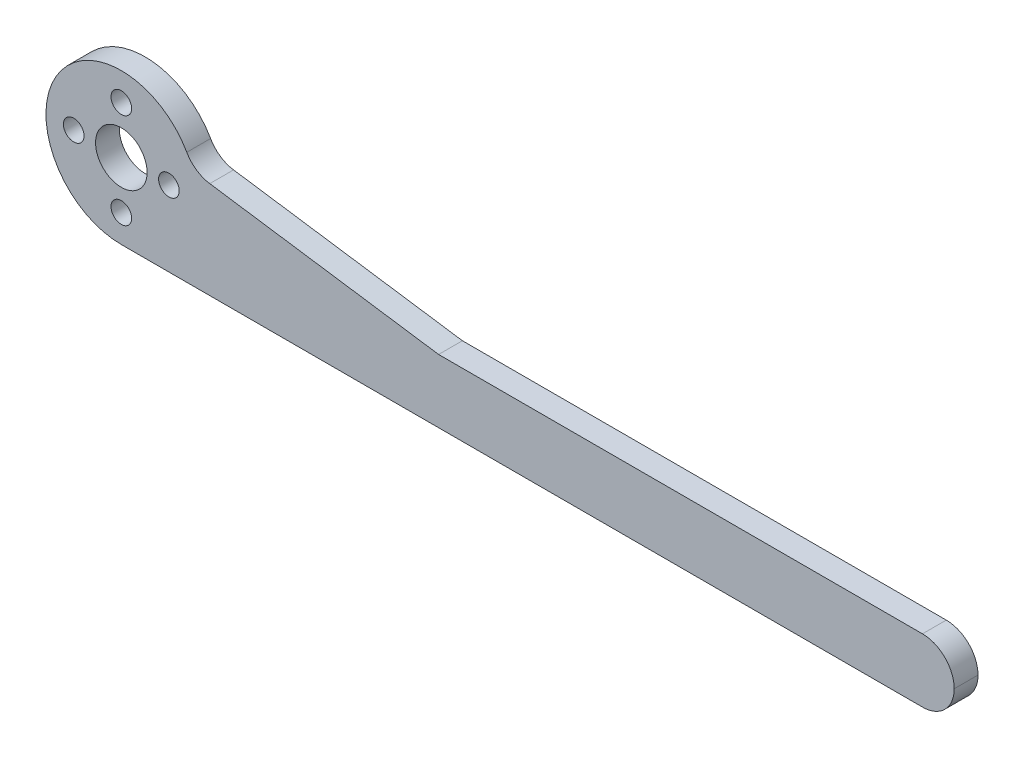
ISO-10303-21;
HEADER;
FILE_DESCRIPTION(('STEP AP214'),'2;1');
FILE_NAME('part.step','',(''),(''),'','','');
FILE_SCHEMA(('AUTOMOTIVE_DESIGN { 1 0 10303 214 1 1 1 1 }'));
ENDSEC;
DATA;
#1=APPLICATION_CONTEXT('core data for automotive mechanical design processes');
#2=APPLICATION_PROTOCOL_DEFINITION('international standard','automotive_design',2000,#1);
#3=PRODUCT_CONTEXT('',#1,'mechanical');
#4=PRODUCT('Part','Part','',(#3));
#5=PRODUCT_RELATED_PRODUCT_CATEGORY('part','',(#4));
#6=PRODUCT_DEFINITION_FORMATION('','',#4);
#7=PRODUCT_DEFINITION_CONTEXT('part definition',#1,'design');
#8=PRODUCT_DEFINITION('design','',#6,#7);
#9=PRODUCT_DEFINITION_SHAPE('','',#8);
#10=(LENGTH_UNIT() NAMED_UNIT(*) SI_UNIT(.MILLI.,.METRE.));
#11=(NAMED_UNIT(*) PLANE_ANGLE_UNIT() SI_UNIT($,.RADIAN.));
#12=(NAMED_UNIT(*) SI_UNIT($,.STERADIAN.) SOLID_ANGLE_UNIT());
#13=UNCERTAINTY_MEASURE_WITH_UNIT(LENGTH_MEASURE(1.E-05),#10,'distance_accuracy_value','');
#14=(GEOMETRIC_REPRESENTATION_CONTEXT(3) GLOBAL_UNCERTAINTY_ASSIGNED_CONTEXT((#13)) GLOBAL_UNIT_ASSIGNED_CONTEXT((#10,
#11,#12)) REPRESENTATION_CONTEXT('',''));
#15=CARTESIAN_POINT('',(0.,0.,0.));
#16=DIRECTION('',(0.,0.,1.));
#17=DIRECTION('',(1.,0.,0.));
#18=AXIS2_PLACEMENT_3D('',#15,#16,#17);
#19=CARTESIAN_POINT('',(0.,0.,3.));
#20=DIRECTION('',(0.,0.,1.));
#21=DIRECTION('',(1.,0.,0.));
#22=AXIS2_PLACEMENT_3D('',#19,#20,#21);
#23=PLANE('',#22);
#24=DIRECTION('',(1.,0.,0.));
#25=VECTOR('',#24,1.);
#26=CARTESIAN_POINT('',(0.,-9.5,3.));
#27=LINE('',#26,#25);
#28=CARTESIAN_POINT('',(0.,-9.5,3.));
#29=VERTEX_POINT('',#28);
#30=CARTESIAN_POINT('',(101.,-9.50000000000001,3.));
#31=VERTEX_POINT('',#30);
#32=EDGE_CURVE('E112',#29,#31,#27,.T.);
#33=ORIENTED_EDGE('',*,*,#32,.T.);
#34=CARTESIAN_POINT('',(101.,-5.5,3.));
#35=DIRECTION('',(0.,0.,1.));
#36=DIRECTION('',(1.,0.,0.));
#37=AXIS2_PLACEMENT_3D('',#34,#35,#36);
#38=CIRCLE('',#37,4.);
#39=CARTESIAN_POINT('',(105.,-5.49999999999999,3.));
#40=VERTEX_POINT('',#39);
#41=EDGE_CURVE('E163',#31,#40,#38,.T.);
#42=ORIENTED_EDGE('',*,*,#41,.T.);
#43=CARTESIAN_POINT('',(101.,-5.49999999999999,3.));
#44=DIRECTION('',(0.,0.,1.));
#45=DIRECTION('',(1.,0.,0.));
#46=AXIS2_PLACEMENT_3D('',#43,#44,#45);
#47=CIRCLE('',#46,4.);
#48=CARTESIAN_POINT('',(101.,-1.49999999999999,3.));
#49=VERTEX_POINT('',#48);
#50=EDGE_CURVE('E98',#40,#49,#47,.T.);
#51=ORIENTED_EDGE('',*,*,#50,.T.);
#52=DIRECTION('',(-1.,0.,0.));
#53=VECTOR('',#52,1.);
#54=CARTESIAN_POINT('',(105.,-1.49999999999999,3.));
#55=LINE('',#54,#53);
#56=CARTESIAN_POINT('',(40.,-1.5,3.));
#57=VERTEX_POINT('',#56);
#58=EDGE_CURVE('E92',#49,#57,#55,.T.);
#59=ORIENTED_EDGE('',*,*,#58,.T.);
#60=DIRECTION('',(-0.989439121592292,0.144949041606608,0.));
#61=VECTOR('',#60,1.);
#62=CARTESIAN_POINT('',(40.,-1.5,3.));
#63=LINE('',#62,#61);
#64=CARTESIAN_POINT('',(11.1492437408619,2.72652528905268,3.));
#65=VERTEX_POINT('',#64);
#66=EDGE_CURVE('E96',#57,#65,#63,.T.);
#67=ORIENTED_EDGE('',*,*,#66,.T.);
#68=CARTESIAN_POINT('',(11.7290399072884,6.68428177542185,3.));
#69=DIRECTION('',(0.,0.,1.));
#70=DIRECTION('',(1.,0.,0.));
#71=AXIS2_PLACEMENT_3D('',#68,#69,#70);
#72=CIRCLE('',#71,4.);
#73=CARTESIAN_POINT('',(8.25376882364738,4.70375384196352,3.));
#74=VERTEX_POINT('',#73);
#75=EDGE_CURVE('E42',#65,#74,#72,.F.);
#76=ORIENTED_EDGE('',*,*,#75,.T.);
#77=CARTESIAN_POINT('',(0.,0.,3.));
#78=DIRECTION('',(0.,0.,1.));
#79=DIRECTION('',(1.,0.,0.));
#80=AXIS2_PLACEMENT_3D('',#77,#78,#79);
#81=CIRCLE('',#80,9.5);
#82=EDGE_CURVE('E153',#74,#29,#81,.T.);
#83=ORIENTED_EDGE('',*,*,#82,.T.);
#84=EDGE_LOOP('',(#33,#42,#51,#59,#67,#76,#83));
#85=FACE_BOUND('',#84,.T.);
#86=CARTESIAN_POINT('',(0.,-6.,3.));
#87=DIRECTION('',(0.,0.,1.));
#88=DIRECTION('',(-1.,0.,0.));
#89=AXIS2_PLACEMENT_3D('',#86,#87,#88);
#90=CIRCLE('',#89,1.3);
#91=CARTESIAN_POINT('',(-1.3,-6.,3.));
#92=VERTEX_POINT('',#91);
#93=EDGE_CURVE('E129',#92,#92,#90,.T.);
#94=ORIENTED_EDGE('',*,*,#93,.F.);
#95=EDGE_LOOP('',(#94));
#96=FACE_BOUND('',#95,.T.);
#97=CARTESIAN_POINT('',(0.,6.,3.));
#98=DIRECTION('',(0.,0.,1.));
#99=DIRECTION('',(1.,0.,0.));
#100=AXIS2_PLACEMENT_3D('',#97,#98,#99);
#101=CIRCLE('',#100,1.3);
#102=CARTESIAN_POINT('',(1.3,6.,3.));
#103=VERTEX_POINT('',#102);
#104=EDGE_CURVE('E141',#103,#103,#101,.T.);
#105=ORIENTED_EDGE('',*,*,#104,.F.);
#106=EDGE_LOOP('',(#105));
#107=FACE_BOUND('',#106,.T.);
#108=CARTESIAN_POINT('',(6.,0.,3.));
#109=DIRECTION('',(0.,0.,1.));
#110=DIRECTION('',(1.,0.,0.));
#111=AXIS2_PLACEMENT_3D('',#108,#109,#110);
#112=CIRCLE('',#111,1.3);
#113=CARTESIAN_POINT('',(7.3,0.,3.));
#114=VERTEX_POINT('',#113);
#115=EDGE_CURVE('E147',#114,#114,#112,.T.);
#116=ORIENTED_EDGE('',*,*,#115,.F.);
#117=EDGE_LOOP('',(#116));
#118=FACE_BOUND('',#117,.T.);
#119=CARTESIAN_POINT('',(-6.,0.,3.));
#120=DIRECTION('',(0.,0.,1.));
#121=DIRECTION('',(-1.,0.,0.));
#122=AXIS2_PLACEMENT_3D('',#119,#120,#121);
#123=CIRCLE('',#122,1.3);
#124=CARTESIAN_POINT('',(-7.3,0.,3.));
#125=VERTEX_POINT('',#124);
#126=EDGE_CURVE('E135',#125,#125,#123,.T.);
#127=ORIENTED_EDGE('',*,*,#126,.F.);
#128=EDGE_LOOP('',(#127));
#129=FACE_BOUND('',#128,.T.);
#130=CARTESIAN_POINT('',(0.,0.,3.));
#131=DIRECTION('',(0.,0.,1.));
#132=DIRECTION('',(1.,0.,0.));
#133=AXIS2_PLACEMENT_3D('',#130,#131,#132);
#134=CIRCLE('',#133,3.25);
#135=CARTESIAN_POINT('',(3.25,0.,3.));
#136=VERTEX_POINT('',#135);
#137=EDGE_CURVE('E119',#136,#136,#134,.T.);
#138=ORIENTED_EDGE('',*,*,#137,.F.);
#139=EDGE_LOOP('',(#138));
#140=FACE_BOUND('',#139,.T.);
#141=ADVANCED_FACE('F33',(#85,#96,#107,#118,#129,#140),#23,.T.);
#142=CARTESIAN_POINT('',(0.,0.,0.));
#143=DIRECTION('',(0.,0.,1.));
#144=DIRECTION('',(1.,0.,0.));
#145=AXIS2_PLACEMENT_3D('',#142,#143,#144);
#146=PLANE('',#145);
#147=CARTESIAN_POINT('',(101.,-5.49999999999999,0.));
#148=DIRECTION('',(0.,0.,1.));
#149=DIRECTION('',(1.,0.,0.));
#150=AXIS2_PLACEMENT_3D('',#147,#148,#149);
#151=CIRCLE('',#150,4.);
#152=CARTESIAN_POINT('',(101.,-1.49999999999999,0.));
#153=VERTEX_POINT('',#152);
#154=CARTESIAN_POINT('',(105.,-5.49999999999999,0.));
#155=VERTEX_POINT('',#154);
#156=EDGE_CURVE('E49',#153,#155,#151,.F.);
#157=ORIENTED_EDGE('',*,*,#156,.T.);
#158=CARTESIAN_POINT('',(101.,-5.5,0.));
#159=DIRECTION('',(0.,0.,1.));
#160=DIRECTION('',(1.,0.,0.));
#161=AXIS2_PLACEMENT_3D('',#158,#159,#160);
#162=CIRCLE('',#161,4.);
#163=CARTESIAN_POINT('',(101.,-9.50000000000001,0.));
#164=VERTEX_POINT('',#163);
#165=EDGE_CURVE('E166',#155,#164,#162,.F.);
#166=ORIENTED_EDGE('',*,*,#165,.T.);
#167=DIRECTION('',(1.,0.,0.));
#168=VECTOR('',#167,1.);
#169=CARTESIAN_POINT('',(0.,-9.5,0.));
#170=LINE('',#169,#168);
#171=CARTESIAN_POINT('',(0.,-9.5,0.));
#172=VERTEX_POINT('',#171);
#173=EDGE_CURVE('E111',#172,#164,#170,.T.);
#174=ORIENTED_EDGE('',*,*,#173,.F.);
#175=CARTESIAN_POINT('',(0.,0.,0.));
#176=DIRECTION('',(0.,0.,1.));
#177=DIRECTION('',(1.,0.,0.));
#178=AXIS2_PLACEMENT_3D('',#175,#176,#177);
#179=CIRCLE('',#178,9.5);
#180=CARTESIAN_POINT('',(8.25376882364738,4.70375384196352,0.));
#181=VERTEX_POINT('',#180);
#182=EDGE_CURVE('E150',#181,#172,#179,.T.);
#183=ORIENTED_EDGE('',*,*,#182,.F.);
#184=CARTESIAN_POINT('',(11.7290399072884,6.68428177542185,0.));
#185=DIRECTION('',(0.,0.,1.));
#186=DIRECTION('',(1.,0.,0.));
#187=AXIS2_PLACEMENT_3D('',#184,#185,#186);
#188=CIRCLE('',#187,4.);
#189=CARTESIAN_POINT('',(11.1492437408619,2.72652528905268,0.));
#190=VERTEX_POINT('',#189);
#191=EDGE_CURVE('E11',#181,#190,#188,.T.);
#192=ORIENTED_EDGE('',*,*,#191,.T.);
#193=DIRECTION('',(-0.989439121592292,0.144949041606608,0.));
#194=VECTOR('',#193,1.);
#195=CARTESIAN_POINT('',(40.,-1.5,0.));
#196=LINE('',#195,#194);
#197=CARTESIAN_POINT('',(40.,-1.5,0.));
#198=VERTEX_POINT('',#197);
#199=EDGE_CURVE('E122',#198,#190,#196,.T.);
#200=ORIENTED_EDGE('',*,*,#199,.F.);
#201=DIRECTION('',(-1.,0.,0.));
#202=VECTOR('',#201,1.);
#203=CARTESIAN_POINT('',(105.,-1.49999999999999,0.));
#204=LINE('',#203,#202);
#205=EDGE_CURVE('E100',#153,#198,#204,.T.);
#206=ORIENTED_EDGE('',*,*,#205,.F.);
#207=EDGE_LOOP('',(#157,#166,#174,#183,#192,#200,#206));
#208=FACE_BOUND('',#207,.T.);
#209=CARTESIAN_POINT('',(6.,0.,0.));
#210=DIRECTION('',(0.,0.,1.));
#211=DIRECTION('',(1.,0.,0.));
#212=AXIS2_PLACEMENT_3D('',#209,#210,#211);
#213=CIRCLE('',#212,1.3);
#214=CARTESIAN_POINT('',(7.3,0.,0.));
#215=VERTEX_POINT('',#214);
#216=EDGE_CURVE('E144',#215,#215,#213,.T.);
#217=ORIENTED_EDGE('',*,*,#216,.T.);
#218=EDGE_LOOP('',(#217));
#219=FACE_BOUND('',#218,.T.);
#220=CARTESIAN_POINT('',(0.,6.,0.));
#221=DIRECTION('',(0.,0.,1.));
#222=DIRECTION('',(1.,0.,0.));
#223=AXIS2_PLACEMENT_3D('',#220,#221,#222);
#224=CIRCLE('',#223,1.3);
#225=CARTESIAN_POINT('',(1.3,6.,0.));
#226=VERTEX_POINT('',#225);
#227=EDGE_CURVE('E138',#226,#226,#224,.T.);
#228=ORIENTED_EDGE('',*,*,#227,.T.);
#229=EDGE_LOOP('',(#228));
#230=FACE_BOUND('',#229,.T.);
#231=CARTESIAN_POINT('',(-6.,0.,0.));
#232=DIRECTION('',(0.,0.,1.));
#233=DIRECTION('',(-1.,0.,0.));
#234=AXIS2_PLACEMENT_3D('',#231,#232,#233);
#235=CIRCLE('',#234,1.3);
#236=CARTESIAN_POINT('',(-7.3,0.,0.));
#237=VERTEX_POINT('',#236);
#238=EDGE_CURVE('E132',#237,#237,#235,.T.);
#239=ORIENTED_EDGE('',*,*,#238,.T.);
#240=EDGE_LOOP('',(#239));
#241=FACE_BOUND('',#240,.T.);
#242=CARTESIAN_POINT('',(0.,-6.,0.));
#243=DIRECTION('',(0.,0.,1.));
#244=DIRECTION('',(-1.,0.,0.));
#245=AXIS2_PLACEMENT_3D('',#242,#243,#244);
#246=CIRCLE('',#245,1.3);
#247=CARTESIAN_POINT('',(-1.3,-6.,0.));
#248=VERTEX_POINT('',#247);
#249=EDGE_CURVE('E127',#248,#248,#246,.T.);
#250=ORIENTED_EDGE('',*,*,#249,.T.);
#251=EDGE_LOOP('',(#250));
#252=FACE_BOUND('',#251,.T.);
#253=CARTESIAN_POINT('',(0.,0.,0.));
#254=DIRECTION('',(0.,0.,1.));
#255=DIRECTION('',(1.,0.,0.));
#256=AXIS2_PLACEMENT_3D('',#253,#254,#255);
#257=CIRCLE('',#256,3.25);
#258=CARTESIAN_POINT('',(3.25,0.,0.));
#259=VERTEX_POINT('',#258);
#260=EDGE_CURVE('E115',#259,#259,#257,.T.);
#261=ORIENTED_EDGE('',*,*,#260,.T.);
#262=EDGE_LOOP('',(#261));
#263=FACE_BOUND('',#262,.T.);
#264=ADVANCED_FACE('F179',(#208,#219,#230,#241,#252,#263),#146,.F.);
#265=CARTESIAN_POINT('',(0.,0.,3.));
#266=DIRECTION('',(0.,0.,-1.));
#267=DIRECTION('',(-1.,0.,0.));
#268=AXIS2_PLACEMENT_3D('',#265,#266,#267);
#269=CYLINDRICAL_SURFACE('',#268,9.5);
#270=ORIENTED_EDGE('',*,*,#82,.F.);
#271=DIRECTION('',(0.,0.,-1.));
#272=VECTOR('',#271,1.);
#273=CARTESIAN_POINT('',(8.25376882364738,4.70375384196352,3.));
#274=LINE('',#273,#272);
#275=EDGE_CURVE('E157',#74,#181,#274,.T.);
#276=ORIENTED_EDGE('',*,*,#275,.T.);
#277=ORIENTED_EDGE('',*,*,#182,.T.);
#278=DIRECTION('',(0.,0.,1.));
#279=VECTOR('',#278,1.);
#280=CARTESIAN_POINT('',(0.,-9.5,0.));
#281=LINE('',#280,#279);
#282=EDGE_CURVE('E116',#172,#29,#281,.T.);
#283=ORIENTED_EDGE('',*,*,#282,.T.);
#284=EDGE_LOOP('',(#270,#276,#277,#283));
#285=FACE_BOUND('',#284,.T.);
#286=ADVANCED_FACE('F174',(#285),#269,.T.);
#287=CARTESIAN_POINT('',(6.,0.,3.));
#288=DIRECTION('',(0.,0.,-1.));
#289=DIRECTION('',(-1.,0.,0.));
#290=AXIS2_PLACEMENT_3D('',#287,#288,#289);
#291=CYLINDRICAL_SURFACE('',#290,1.3);
#292=ORIENTED_EDGE('',*,*,#115,.T.);
#293=EDGE_LOOP('',(#292));
#294=FACE_BOUND('',#293,.T.);
#295=ORIENTED_EDGE('',*,*,#216,.F.);
#296=EDGE_LOOP('',(#295));
#297=FACE_BOUND('',#296,.T.);
#298=ADVANCED_FACE('F208',(#294,#297),#291,.F.);
#299=CARTESIAN_POINT('',(0.,6.,3.));
#300=DIRECTION('',(0.,0.,-1.));
#301=DIRECTION('',(-1.,0.,0.));
#302=AXIS2_PLACEMENT_3D('',#299,#300,#301);
#303=CYLINDRICAL_SURFACE('',#302,1.3);
#304=ORIENTED_EDGE('',*,*,#104,.T.);
#305=EDGE_LOOP('',(#304));
#306=FACE_BOUND('',#305,.T.);
#307=ORIENTED_EDGE('',*,*,#227,.F.);
#308=EDGE_LOOP('',(#307));
#309=FACE_BOUND('',#308,.T.);
#310=ADVANCED_FACE('F217',(#306,#309),#303,.F.);
#311=CARTESIAN_POINT('',(-6.,0.,3.));
#312=DIRECTION('',(0.,0.,-1.));
#313=DIRECTION('',(-1.,0.,0.));
#314=AXIS2_PLACEMENT_3D('',#311,#312,#313);
#315=CYLINDRICAL_SURFACE('',#314,1.3);
#316=ORIENTED_EDGE('',*,*,#126,.T.);
#317=EDGE_LOOP('',(#316));
#318=FACE_BOUND('',#317,.T.);
#319=ORIENTED_EDGE('',*,*,#238,.F.);
#320=EDGE_LOOP('',(#319));
#321=FACE_BOUND('',#320,.T.);
#322=ADVANCED_FACE('F222',(#318,#321),#315,.F.);
#323=CARTESIAN_POINT('',(0.,-6.,3.));
#324=DIRECTION('',(0.,0.,-1.));
#325=DIRECTION('',(-1.,0.,0.));
#326=AXIS2_PLACEMENT_3D('',#323,#324,#325);
#327=CYLINDRICAL_SURFACE('',#326,1.3);
#328=ORIENTED_EDGE('',*,*,#93,.T.);
#329=EDGE_LOOP('',(#328));
#330=FACE_BOUND('',#329,.T.);
#331=ORIENTED_EDGE('',*,*,#249,.F.);
#332=EDGE_LOOP('',(#331));
#333=FACE_BOUND('',#332,.T.);
#334=ADVANCED_FACE('F238',(#330,#333),#327,.F.);
#335=CARTESIAN_POINT('',(0.,0.,3.));
#336=DIRECTION('',(0.,0.,-1.));
#337=DIRECTION('',(-1.,0.,0.));
#338=AXIS2_PLACEMENT_3D('',#335,#336,#337);
#339=CYLINDRICAL_SURFACE('',#338,3.25);
#340=ORIENTED_EDGE('',*,*,#137,.T.);
#341=EDGE_LOOP('',(#340));
#342=FACE_BOUND('',#341,.T.);
#343=ORIENTED_EDGE('',*,*,#260,.F.);
#344=EDGE_LOOP('',(#343));
#345=FACE_BOUND('',#344,.T.);
#346=ADVANCED_FACE('F236',(#342,#345),#339,.F.);
#347=CARTESIAN_POINT('',(40.,-1.5,0.));
#348=DIRECTION('',(0.144949041606608,0.989439121592292,0.));
#349=DIRECTION('',(-0.989439121592292,0.144949041606608,0.));
#350=AXIS2_PLACEMENT_3D('',#347,#348,#349);
#351=PLANE('',#350);
#352=ORIENTED_EDGE('',*,*,#199,.T.);
#353=DIRECTION('',(0.,0.,-1.));
#354=VECTOR('',#353,1.);
#355=CARTESIAN_POINT('',(11.1492437408619,2.72652528905268,0.));
#356=LINE('',#355,#354);
#357=EDGE_CURVE('E110',#190,#65,#356,.F.);
#358=ORIENTED_EDGE('',*,*,#357,.T.);
#359=ORIENTED_EDGE('',*,*,#66,.F.);
#360=DIRECTION('',(0.,0.,1.));
#361=VECTOR('',#360,1.);
#362=CARTESIAN_POINT('',(40.,-1.5,0.));
#363=LINE('',#362,#361);
#364=EDGE_CURVE('E107',#198,#57,#363,.T.);
#365=ORIENTED_EDGE('',*,*,#364,.F.);
#366=EDGE_LOOP('',(#352,#358,#359,#365));
#367=FACE_BOUND('',#366,.T.);
#368=ADVANCED_FACE('F106',(#367),#351,.T.);
#369=CARTESIAN_POINT('',(0.,-9.5,0.));
#370=DIRECTION('',(0.,-1.,0.));
#371=DIRECTION('',(1.,0.,0.));
#372=AXIS2_PLACEMENT_3D('',#369,#370,#371);
#373=PLANE('',#372);
#374=ORIENTED_EDGE('',*,*,#173,.T.);
#375=DIRECTION('',(0.,0.,1.));
#376=VECTOR('',#375,1.);
#377=CARTESIAN_POINT('',(101.,-9.50000000000001,0.));
#378=LINE('',#377,#376);
#379=EDGE_CURVE('E159',#164,#31,#378,.T.);
#380=ORIENTED_EDGE('',*,*,#379,.T.);
#381=ORIENTED_EDGE('',*,*,#32,.F.);
#382=ORIENTED_EDGE('',*,*,#282,.F.);
#383=EDGE_LOOP('',(#374,#380,#381,#382));
#384=FACE_BOUND('',#383,.T.);
#385=ADVANCED_FACE('F187',(#384),#373,.T.);
#386=CARTESIAN_POINT('',(105.,-1.49999999999999,0.));
#387=DIRECTION('',(0.,1.,0.));
#388=DIRECTION('',(-1.,0.,0.));
#389=AXIS2_PLACEMENT_3D('',#386,#387,#388);
#390=PLANE('',#389);
#391=ORIENTED_EDGE('',*,*,#58,.F.);
#392=DIRECTION('',(0.,0.,1.));
#393=VECTOR('',#392,1.);
#394=CARTESIAN_POINT('',(101.,-1.49999999999999,0.));
#395=LINE('',#394,#393);
#396=EDGE_CURVE('E57',#49,#153,#395,.F.);
#397=ORIENTED_EDGE('',*,*,#396,.T.);
#398=ORIENTED_EDGE('',*,*,#205,.T.);
#399=ORIENTED_EDGE('',*,*,#364,.T.);
#400=EDGE_LOOP('',(#391,#397,#398,#399));
#401=FACE_BOUND('',#400,.T.);
#402=ADVANCED_FACE('F114',(#401),#390,.T.);
#403=CARTESIAN_POINT('',(11.7290399072884,6.68428177542185,3.));
#404=DIRECTION('',(0.,0.,-1.));
#405=DIRECTION('',(-1.,0.,0.));
#406=AXIS2_PLACEMENT_3D('',#403,#404,#405);
#407=CYLINDRICAL_SURFACE('',#406,4.);
#408=ORIENTED_EDGE('',*,*,#191,.F.);
#409=ORIENTED_EDGE('',*,*,#275,.F.);
#410=ORIENTED_EDGE('',*,*,#75,.F.);
#411=ORIENTED_EDGE('',*,*,#357,.F.);
#412=EDGE_LOOP('',(#408,#409,#410,#411));
#413=FACE_BOUND('',#412,.T.);
#414=ADVANCED_FACE('F178',(#413),#407,.F.);
#415=CARTESIAN_POINT('',(101.,-5.49999999999999,0.));
#416=DIRECTION('',(0.,0.,1.));
#417=DIRECTION('',(1.,0.,0.));
#418=AXIS2_PLACEMENT_3D('',#415,#416,#417);
#419=CYLINDRICAL_SURFACE('',#418,4.);
#420=DIRECTION('',(0.,0.,1.));
#421=VECTOR('',#420,1.);
#422=CARTESIAN_POINT('',(105.,-5.49999999999999,0.));
#423=LINE('',#422,#421);
#424=EDGE_CURVE('E37',#155,#40,#423,.T.);
#425=ORIENTED_EDGE('',*,*,#424,.F.);
#426=ORIENTED_EDGE('',*,*,#156,.F.);
#427=ORIENTED_EDGE('',*,*,#396,.F.);
#428=ORIENTED_EDGE('',*,*,#50,.F.);
#429=EDGE_LOOP('',(#425,#426,#427,#428));
#430=FACE_BOUND('',#429,.T.);
#431=ADVANCED_FACE('F35',(#430),#419,.T.);
#432=CARTESIAN_POINT('',(101.,-5.5,0.));
#433=DIRECTION('',(0.,0.,1.));
#434=DIRECTION('',(1.,0.,0.));
#435=AXIS2_PLACEMENT_3D('',#432,#433,#434);
#436=CYLINDRICAL_SURFACE('',#435,4.);
#437=ORIENTED_EDGE('',*,*,#165,.F.);
#438=ORIENTED_EDGE('',*,*,#424,.T.);
#439=ORIENTED_EDGE('',*,*,#41,.F.);
#440=ORIENTED_EDGE('',*,*,#379,.F.);
#441=EDGE_LOOP('',(#437,#438,#439,#440));
#442=FACE_BOUND('',#441,.T.);
#443=ADVANCED_FACE('F191',(#442),#436,.T.);
#444=CLOSED_SHELL('',(#141,#264,#286,#298,#310,#322,#334,#346,#368,#385,#402,#414,#431,#443));
#445=MANIFOLD_SOLID_BREP('B2',#444);
#446=ADVANCED_BREP_SHAPE_REPRESENTATION('',(#18,#445),#14);
#447=SHAPE_DEFINITION_REPRESENTATION(#9,#446);
ENDSEC;
END-ISO-10303-21;
